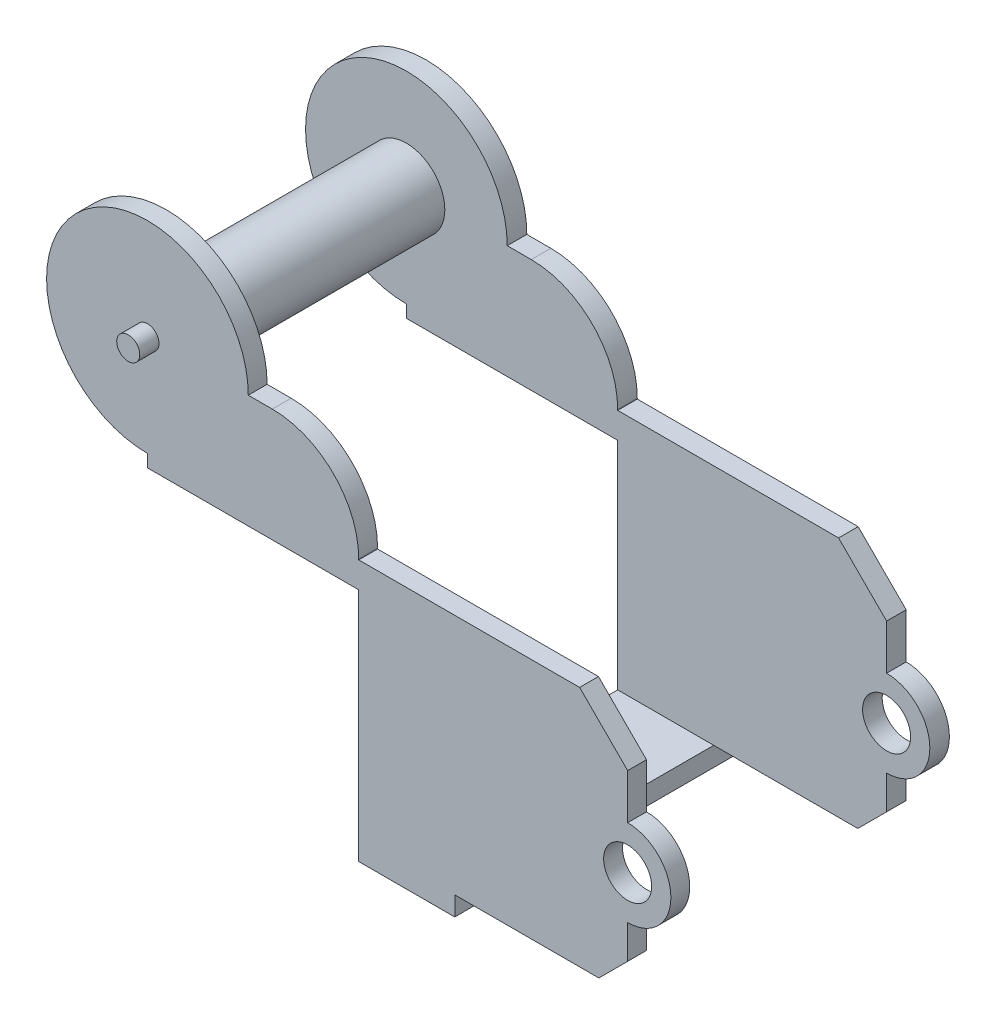
ISO-10303-21;
HEADER;
FILE_DESCRIPTION(('STEP AP214'),'2;1');
FILE_NAME('part.step','',(''),(''),'','','');
FILE_SCHEMA(('AUTOMOTIVE_DESIGN { 1 0 10303 214 1 1 1 1 }'));
ENDSEC;
DATA;
#1=APPLICATION_CONTEXT('core data for automotive mechanical design processes');
#2=APPLICATION_PROTOCOL_DEFINITION('international standard','automotive_design',2000,#1);
#3=PRODUCT_CONTEXT('',#1,'mechanical');
#4=PRODUCT('Part','Part','',(#3));
#5=PRODUCT_RELATED_PRODUCT_CATEGORY('part','',(#4));
#6=PRODUCT_DEFINITION_FORMATION('','',#4);
#7=PRODUCT_DEFINITION_CONTEXT('part definition',#1,'design');
#8=PRODUCT_DEFINITION('design','',#6,#7);
#9=PRODUCT_DEFINITION_SHAPE('','',#8);
#10=(LENGTH_UNIT() NAMED_UNIT(*) SI_UNIT(.MILLI.,.METRE.));
#11=(NAMED_UNIT(*) PLANE_ANGLE_UNIT() SI_UNIT($,.RADIAN.));
#12=(NAMED_UNIT(*) SI_UNIT($,.STERADIAN.) SOLID_ANGLE_UNIT());
#13=UNCERTAINTY_MEASURE_WITH_UNIT(LENGTH_MEASURE(1.E-05),#10,'distance_accuracy_value','');
#14=(GEOMETRIC_REPRESENTATION_CONTEXT(3) GLOBAL_UNCERTAINTY_ASSIGNED_CONTEXT((#13)) GLOBAL_UNIT_ASSIGNED_CONTEXT((#10,
#11,#12)) REPRESENTATION_CONTEXT('',''));
#15=CARTESIAN_POINT('',(0.,0.,0.));
#16=DIRECTION('',(0.,0.,1.));
#17=DIRECTION('',(1.,0.,0.));
#18=AXIS2_PLACEMENT_3D('',#15,#16,#17);
#19=CARTESIAN_POINT('',(-23.562506415874,1.656806257323E-12,29.));
#20=DIRECTION('',(-1.,0.,0.));
#21=DIRECTION('',(0.,-1.,0.));
#22=AXIS2_PLACEMENT_3D('',#19,#20,#21);
#23=PLANE('',#22);
#24=DIRECTION('',(0.,0.,-1.));
#25=VECTOR('',#24,1.);
#26=CARTESIAN_POINT('',(-23.562506415872,27.5988808660211,29.));
#27=LINE('',#26,#25);
#28=CARTESIAN_POINT('',(-23.562506415872,27.5988808660211,2.03798740926687));
#29=VERTEX_POINT('',#28);
#30=CARTESIAN_POINT('',(-23.562506415872,27.5988808660211,0.));
#31=VERTEX_POINT('',#30);
#32=EDGE_CURVE('E293',#29,#31,#27,.T.);
#33=ORIENTED_EDGE('',*,*,#32,.F.);
#34=DIRECTION('',(0.,-1.,0.));
#35=VECTOR('',#34,1.);
#36=CARTESIAN_POINT('',(-23.562506415874,1.656806257323E-12,2.03798740926687));
#37=LINE('',#36,#35);
#38=CARTESIAN_POINT('',(-23.5625064158721,27.5001983970195,2.03798740926687));
#39=VERTEX_POINT('',#38);
#40=EDGE_CURVE('E457',#29,#39,#37,.T.);
#41=ORIENTED_EDGE('',*,*,#40,.T.);
#42=DIRECTION('',(0.,0.,-1.));
#43=VECTOR('',#42,1.);
#44=CARTESIAN_POINT('',(-23.5625064158721,27.5001983970195,29.));
#45=LINE('',#44,#43);
#46=CARTESIAN_POINT('',(-23.5625064158721,27.5001983970195,0.));
#47=VERTEX_POINT('',#46);
#48=EDGE_CURVE('E117',#39,#47,#45,.T.);
#49=ORIENTED_EDGE('',*,*,#48,.T.);
#50=DIRECTION('',(0.,1.,0.));
#51=VECTOR('',#50,1.);
#52=CARTESIAN_POINT('',(-23.562506415874,1.656806257323E-12,0.));
#53=LINE('',#52,#51);
#54=EDGE_CURVE('E200',#47,#31,#53,.T.);
#55=ORIENTED_EDGE('',*,*,#54,.T.);
#56=EDGE_LOOP('',(#33,#41,#49,#55));
#57=FACE_BOUND('',#56,.T.);
#58=ADVANCED_FACE('F39',(#57),#23,.F.);
#59=CARTESIAN_POINT('',(-32.562506415872,27.5988808660211,29.));
#60=DIRECTION('',(0.,0.,-1.));
#61=DIRECTION('',(-1.,0.,0.));
#62=AXIS2_PLACEMENT_3D('',#59,#60,#61);
#63=CYLINDRICAL_SURFACE('',#62,9.);
#64=DIRECTION('',(0.,0.,-1.));
#65=VECTOR('',#64,1.);
#66=CARTESIAN_POINT('',(-32.5625064158721,36.5988808660211,29.));
#67=LINE('',#66,#65);
#68=CARTESIAN_POINT('',(-32.5625064158721,36.5988808660211,2.03798740926687));
#69=VERTEX_POINT('',#68);
#70=CARTESIAN_POINT('',(-32.5625064158721,36.5988808660211,0.));
#71=VERTEX_POINT('',#70);
#72=EDGE_CURVE('E289',#69,#71,#67,.T.);
#73=ORIENTED_EDGE('',*,*,#72,.F.);
#74=CARTESIAN_POINT('',(-32.562506415872,27.5988808660211,2.03798740926687));
#75=DIRECTION('',(0.,0.,-1.));
#76=DIRECTION('',(-1.,0.,0.));
#77=AXIS2_PLACEMENT_3D('',#74,#75,#76);
#78=CIRCLE('',#77,9.);
#79=EDGE_CURVE('E459',#69,#29,#78,.T.);
#80=ORIENTED_EDGE('',*,*,#79,.T.);
#81=ORIENTED_EDGE('',*,*,#32,.T.);
#82=CARTESIAN_POINT('',(-32.562506415872,27.5988808660211,0.));
#83=DIRECTION('',(0.,0.,1.));
#84=DIRECTION('',(1.,0.,0.));
#85=AXIS2_PLACEMENT_3D('',#82,#83,#84);
#86=CIRCLE('',#85,9.);
#87=EDGE_CURVE('E203',#31,#71,#86,.T.);
#88=ORIENTED_EDGE('',*,*,#87,.T.);
#89=EDGE_LOOP('',(#73,#80,#81,#88));
#90=FACE_BOUND('',#89,.T.);
#91=ADVANCED_FACE('F635',(#90),#63,.T.);
#92=CARTESIAN_POINT('',(0.,36.5988808660211,29.));
#93=DIRECTION('',(0.,-1.,0.));
#94=DIRECTION('',(0.,0.,-1.));
#95=AXIS2_PLACEMENT_3D('',#92,#93,#94);
#96=PLANE('',#95);
#97=DIRECTION('',(0.,0.,-1.));
#98=VECTOR('',#97,1.);
#99=CARTESIAN_POINT('',(-35.062506415872,36.5988808660211,29.));
#100=LINE('',#99,#98);
#101=CARTESIAN_POINT('',(-35.062506415872,36.5988808660211,2.03798740926687));
#102=VERTEX_POINT('',#101);
#103=CARTESIAN_POINT('',(-35.062506415872,36.5988808660211,0.));
#104=VERTEX_POINT('',#103);
#105=EDGE_CURVE('E285',#102,#104,#100,.T.);
#106=ORIENTED_EDGE('',*,*,#105,.F.);
#107=DIRECTION('',(1.,0.,0.));
#108=VECTOR('',#107,1.);
#109=CARTESIAN_POINT('',(0.,36.5988808660211,2.03798740926687));
#110=LINE('',#109,#108);
#111=EDGE_CURVE('E462',#102,#69,#110,.T.);
#112=ORIENTED_EDGE('',*,*,#111,.T.);
#113=ORIENTED_EDGE('',*,*,#72,.T.);
#114=DIRECTION('',(-1.,0.,0.));
#115=VECTOR('',#114,1.);
#116=CARTESIAN_POINT('',(0.,36.5988808660211,0.));
#117=LINE('',#116,#115);
#118=EDGE_CURVE('E206',#71,#104,#117,.T.);
#119=ORIENTED_EDGE('',*,*,#118,.T.);
#120=EDGE_LOOP('',(#106,#112,#113,#119));
#121=FACE_BOUND('',#120,.T.);
#122=ADVANCED_FACE('F639',(#121),#96,.F.);
#123=CARTESIAN_POINT('',(-45.562506415872,36.5988808660211,29.));
#124=DIRECTION('',(0.,0.,-1.));
#125=DIRECTION('',(-1.,0.,0.));
#126=AXIS2_PLACEMENT_3D('',#123,#124,#125);
#127=CYLINDRICAL_SURFACE('',#126,10.5);
#128=DIRECTION('',(0.,0.,-1.));
#129=VECTOR('',#128,1.);
#130=CARTESIAN_POINT('',(-45.562506415872,26.0988808660211,29.));
#131=LINE('',#130,#129);
#132=CARTESIAN_POINT('',(-45.562506415872,26.0988808660211,2.03798740926687));
#133=VERTEX_POINT('',#132);
#134=CARTESIAN_POINT('',(-45.562506415872,26.0988808660211,0.));
#135=VERTEX_POINT('',#134);
#136=EDGE_CURVE('E281',#133,#135,#131,.T.);
#137=ORIENTED_EDGE('',*,*,#136,.F.);
#138=CARTESIAN_POINT('',(-45.562506415872,36.5988808660211,2.03798740926687));
#139=DIRECTION('',(0.,0.,-1.));
#140=DIRECTION('',(-1.,0.,0.));
#141=AXIS2_PLACEMENT_3D('',#138,#139,#140);
#142=CIRCLE('',#141,10.5);
#143=EDGE_CURVE('E465',#133,#102,#142,.T.);
#144=ORIENTED_EDGE('',*,*,#143,.T.);
#145=ORIENTED_EDGE('',*,*,#105,.T.);
#146=CARTESIAN_POINT('',(-45.562506415872,36.5988808660211,0.));
#147=DIRECTION('',(0.,0.,1.));
#148=DIRECTION('',(1.,0.,0.));
#149=AXIS2_PLACEMENT_3D('',#146,#147,#148);
#150=CIRCLE('',#149,10.5);
#151=EDGE_CURVE('E209',#104,#135,#150,.T.);
#152=ORIENTED_EDGE('',*,*,#151,.T.);
#153=EDGE_LOOP('',(#137,#144,#145,#152));
#154=FACE_BOUND('',#153,.T.);
#155=ADVANCED_FACE('F654',(#154),#127,.T.);
#156=CARTESIAN_POINT('',(-45.562506415872,0.,29.));
#157=DIRECTION('',(-1.,0.,0.));
#158=DIRECTION('',(0.,0.,1.));
#159=AXIS2_PLACEMENT_3D('',#156,#157,#158);
#160=PLANE('',#159);
#161=DIRECTION('',(0.,-1.,0.));
#162=VECTOR('',#161,1.);
#163=CARTESIAN_POINT('',(-45.562506415872,0.,2.03798740926687));
#164=LINE('',#163,#162);
#165=CARTESIAN_POINT('',(-45.562506415872,24.7988808660211,2.03798740926687));
#166=VERTEX_POINT('',#165);
#167=EDGE_CURVE('E468',#133,#166,#164,.T.);
#168=ORIENTED_EDGE('',*,*,#167,.F.);
#169=ORIENTED_EDGE('',*,*,#136,.T.);
#170=DIRECTION('',(0.,1.,0.));
#171=VECTOR('',#170,1.);
#172=CARTESIAN_POINT('',(-45.562506415872,0.,0.));
#173=LINE('',#172,#171);
#174=CARTESIAN_POINT('',(-45.562506415872,24.7988808660211,0.));
#175=VERTEX_POINT('',#174);
#176=EDGE_CURVE('E212',#175,#135,#173,.T.);
#177=ORIENTED_EDGE('',*,*,#176,.F.);
#178=DIRECTION('',(0.,0.,-1.));
#179=VECTOR('',#178,1.);
#180=CARTESIAN_POINT('',(-45.562506415872,24.7988808660211,29.));
#181=LINE('',#180,#179);
#182=EDGE_CURVE('E277',#166,#175,#181,.T.);
#183=ORIENTED_EDGE('',*,*,#182,.F.);
#184=EDGE_LOOP('',(#168,#169,#177,#183));
#185=FACE_BOUND('',#184,.T.);
#186=ADVANCED_FACE('F657',(#185),#160,.T.);
#187=CARTESIAN_POINT('',(0.,24.7988808660211,29.));
#188=DIRECTION('',(0.,-1.,0.));
#189=DIRECTION('',(0.,0.,-1.));
#190=AXIS2_PLACEMENT_3D('',#187,#188,#189);
#191=PLANE('',#190);
#192=DIRECTION('',(1.,0.,0.));
#193=VECTOR('',#192,1.);
#194=CARTESIAN_POINT('',(0.,24.7988808660211,2.03798740926687));
#195=LINE('',#194,#193);
#196=CARTESIAN_POINT('',(-23.562506415872,24.7988808660211,2.03798740926687));
#197=VERTEX_POINT('',#196);
#198=EDGE_CURVE('E471',#166,#197,#195,.T.);
#199=ORIENTED_EDGE('',*,*,#198,.F.);
#200=ORIENTED_EDGE('',*,*,#182,.T.);
#201=DIRECTION('',(-1.,0.,0.));
#202=VECTOR('',#201,1.);
#203=CARTESIAN_POINT('',(0.,24.7988808660211,0.));
#204=LINE('',#203,#202);
#205=CARTESIAN_POINT('',(-23.562506415872,24.7988808660211,0.));
#206=VERTEX_POINT('',#205);
#207=EDGE_CURVE('E215',#206,#175,#204,.T.);
#208=ORIENTED_EDGE('',*,*,#207,.F.);
#209=DIRECTION('',(0.,0.,-1.));
#210=VECTOR('',#209,1.);
#211=CARTESIAN_POINT('',(-23.562506415872,24.7988808660211,29.));
#212=LINE('',#211,#210);
#213=EDGE_CURVE('E273',#197,#206,#212,.T.);
#214=ORIENTED_EDGE('',*,*,#213,.F.);
#215=EDGE_LOOP('',(#199,#200,#208,#214));
#216=FACE_BOUND('',#215,.T.);
#217=ADVANCED_FACE('F568',(#216),#191,.T.);
#218=CARTESIAN_POINT('',(0.,27.5001983970195,29.));
#219=DIRECTION('',(0.,-1.,0.));
#220=DIRECTION('',(1.,0.,0.));
#221=AXIS2_PLACEMENT_3D('',#218,#219,#220);
#222=PLANE('',#221);
#223=ORIENTED_EDGE('',*,*,#48,.F.);
#224=DIRECTION('',(1.,0.,0.));
#225=VECTOR('',#224,1.);
#226=CARTESIAN_POINT('',(0.,27.5001983970195,2.03798740926687));
#227=LINE('',#226,#225);
#228=CARTESIAN_POINT('',(-0.562506415872049,27.5001983970195,2.03798740926687));
#229=VERTEX_POINT('',#228);
#230=EDGE_CURVE('E11',#39,#229,#227,.T.);
#231=ORIENTED_EDGE('',*,*,#230,.T.);
#232=DIRECTION('',(0.,0.,-1.));
#233=VECTOR('',#232,1.);
#234=CARTESIAN_POINT('',(-0.562506415872049,27.5001983970195,29.));
#235=LINE('',#234,#233);
#236=CARTESIAN_POINT('',(-0.562506415872049,27.5001983970195,0.));
#237=VERTEX_POINT('',#236);
#238=EDGE_CURVE('E109',#229,#237,#235,.T.);
#239=ORIENTED_EDGE('',*,*,#238,.T.);
#240=DIRECTION('',(-1.,0.,0.));
#241=VECTOR('',#240,1.);
#242=CARTESIAN_POINT('',(0.,27.5001983970195,0.));
#243=LINE('',#242,#241);
#244=EDGE_CURVE('E242',#237,#47,#243,.T.);
#245=ORIENTED_EDGE('',*,*,#244,.T.);
#246=EDGE_LOOP('',(#223,#231,#239,#245));
#247=FACE_BOUND('',#246,.T.);
#248=ADVANCED_FACE('F533',(#247),#222,.F.);
#249=CARTESIAN_POINT('',(0.,2.29786024341674,29.));
#250=DIRECTION('',(0.,-1.,0.));
#251=DIRECTION('',(1.,0.,0.));
#252=AXIS2_PLACEMENT_3D('',#249,#250,#251);
#253=PLANE('',#252);
#254=DIRECTION('',(1.,0.,0.));
#255=VECTOR('',#254,1.);
#256=CARTESIAN_POINT('',(-13.562506415872,2.29786024341674,2.03798740926687));
#257=LINE('',#256,#255);
#258=CARTESIAN_POINT('',(-13.562506415872,2.29786024341674,2.03798740926687));
#259=VERTEX_POINT('',#258);
#260=CARTESIAN_POINT('',(1.43749358412795,2.29786024341674,2.03798740926687));
#261=VERTEX_POINT('',#260);
#262=EDGE_CURVE('E482',#259,#261,#257,.T.);
#263=ORIENTED_EDGE('',*,*,#262,.F.);
#264=DIRECTION('',(0.,0.,-1.));
#265=VECTOR('',#264,1.);
#266=CARTESIAN_POINT('',(-13.562506415872,2.29786024341674,29.));
#267=LINE('',#266,#265);
#268=CARTESIAN_POINT('',(-13.562506415872,2.29786024341674,0.));
#269=VERTEX_POINT('',#268);
#270=EDGE_CURVE('E263',#259,#269,#267,.T.);
#271=ORIENTED_EDGE('',*,*,#270,.T.);
#272=DIRECTION('',(-1.,0.,0.));
#273=VECTOR('',#272,1.);
#274=CARTESIAN_POINT('',(0.,2.29786024341674,0.));
#275=LINE('',#274,#273);
#276=CARTESIAN_POINT('',(1.43749358412795,2.29786024341674,0.));
#277=VERTEX_POINT('',#276);
#278=EDGE_CURVE('E225',#277,#269,#275,.T.);
#279=ORIENTED_EDGE('',*,*,#278,.F.);
#280=DIRECTION('',(0.,0.,-1.));
#281=VECTOR('',#280,1.);
#282=CARTESIAN_POINT('',(1.43749358412795,2.29786024341674,29.));
#283=LINE('',#282,#281);
#284=EDGE_CURVE('E259',#261,#277,#283,.T.);
#285=ORIENTED_EDGE('',*,*,#284,.F.);
#286=EDGE_LOOP('',(#263,#271,#279,#285));
#287=FACE_BOUND('',#286,.T.);
#288=ADVANCED_FACE('F625',(#287),#253,.T.);
#289=CARTESIAN_POINT('',(-0.430183329644394,0.430183329644394,29.));
#290=DIRECTION('',(0.707106781186548,-0.707106781186547,0.));
#291=DIRECTION('',(0.707106781186547,0.707106781186548,0.));
#292=AXIS2_PLACEMENT_3D('',#289,#290,#291);
#293=PLANE('',#292);
#294=DIRECTION('',(0.707106781186547,0.707106781186548,0.));
#295=VECTOR('',#294,1.);
#296=CARTESIAN_POINT('',(-0.430183329644394,0.430183329644394,2.03798740926687));
#297=LINE('',#296,#295);
#298=CARTESIAN_POINT('',(4.43749358412795,5.29786024341674,2.03798740926687));
#299=VERTEX_POINT('',#298);
#300=EDGE_CURVE('E391',#261,#299,#297,.T.);
#301=ORIENTED_EDGE('',*,*,#300,.F.);
#302=ORIENTED_EDGE('',*,*,#284,.T.);
#303=DIRECTION('',(-0.707106781186547,-0.707106781186548,0.));
#304=VECTOR('',#303,1.);
#305=CARTESIAN_POINT('',(-0.430183329644394,0.430183329644394,0.));
#306=LINE('',#305,#304);
#307=CARTESIAN_POINT('',(4.43749358412795,5.29786024341674,0.));
#308=VERTEX_POINT('',#307);
#309=EDGE_CURVE('E228',#308,#277,#306,.T.);
#310=ORIENTED_EDGE('',*,*,#309,.F.);
#311=DIRECTION('',(0.,0.,-1.));
#312=VECTOR('',#311,1.);
#313=CARTESIAN_POINT('',(4.43749358412795,5.29786024341674,29.));
#314=LINE('',#313,#312);
#315=EDGE_CURVE('E255',#299,#308,#314,.T.);
#316=ORIENTED_EDGE('',*,*,#315,.F.);
#317=EDGE_LOOP('',(#301,#302,#310,#316));
#318=FACE_BOUND('',#317,.T.);
#319=ADVANCED_FACE('F518',(#318),#293,.T.);
#320=CARTESIAN_POINT('',(4.43749358412795,0.,29.));
#321=DIRECTION('',(1.,0.,0.));
#322=DIRECTION('',(0.,0.,-1.));
#323=AXIS2_PLACEMENT_3D('',#320,#321,#322);
#324=PLANE('',#323);
#325=DIRECTION('',(0.,1.,0.));
#326=VECTOR('',#325,1.);
#327=CARTESIAN_POINT('',(4.43749358412795,0.,2.03798740926687));
#328=LINE('',#327,#326);
#329=CARTESIAN_POINT('',(4.43749358412795,8.79846408844878,2.03798740926687));
#330=VERTEX_POINT('',#329);
#331=EDGE_CURVE('E388',#299,#330,#328,.T.);
#332=ORIENTED_EDGE('',*,*,#331,.F.);
#333=ORIENTED_EDGE('',*,*,#315,.T.);
#334=DIRECTION('',(0.,-1.,0.));
#335=VECTOR('',#334,1.);
#336=CARTESIAN_POINT('',(4.43749358412795,0.,0.));
#337=LINE('',#336,#335);
#338=CARTESIAN_POINT('',(4.43749358412795,8.79846408844878,0.));
#339=VERTEX_POINT('',#338);
#340=EDGE_CURVE('E231',#339,#308,#337,.T.);
#341=ORIENTED_EDGE('',*,*,#340,.F.);
#342=DIRECTION('',(0.,0.,-1.));
#343=VECTOR('',#342,1.);
#344=CARTESIAN_POINT('',(4.43749358412795,8.79846408844878,29.));
#345=LINE('',#344,#343);
#346=EDGE_CURVE('E251',#330,#339,#345,.T.);
#347=ORIENTED_EDGE('',*,*,#346,.F.);
#348=EDGE_LOOP('',(#332,#333,#341,#347));
#349=FACE_BOUND('',#348,.T.);
#350=ADVANCED_FACE('F515',(#349),#324,.T.);
#351=CARTESIAN_POINT('',(4.43749358412795,13.2988808660211,29.));
#352=DIRECTION('',(0.,0.,-1.));
#353=DIRECTION('',(-1.,0.,0.));
#354=AXIS2_PLACEMENT_3D('',#351,#352,#353);
#355=CYLINDRICAL_SURFACE('',#354,4.50041677757234);
#356=DIRECTION('',(0.,0.,-1.));
#357=VECTOR('',#356,1.);
#358=CARTESIAN_POINT('',(4.43749358412795,17.7992976435935,29.));
#359=LINE('',#358,#357);
#360=CARTESIAN_POINT('',(4.43749358412795,17.7992976435935,2.03798740926687));
#361=VERTEX_POINT('',#360);
#362=CARTESIAN_POINT('',(4.43749358412795,17.7992976435935,0.));
#363=VERTEX_POINT('',#362);
#364=EDGE_CURVE('E187',#361,#363,#359,.T.);
#365=ORIENTED_EDGE('',*,*,#364,.F.);
#366=CARTESIAN_POINT('',(4.43749358412795,13.2988808660211,2.03798740926687));
#367=DIRECTION('',(0.,0.,-1.));
#368=DIRECTION('',(-1.,0.,0.));
#369=AXIS2_PLACEMENT_3D('',#366,#367,#368);
#370=CIRCLE('',#369,4.50041677757234);
#371=EDGE_CURVE('E385',#361,#330,#370,.T.);
#372=ORIENTED_EDGE('',*,*,#371,.T.);
#373=ORIENTED_EDGE('',*,*,#346,.T.);
#374=CARTESIAN_POINT('',(4.43749358412795,13.2988808660211,0.));
#375=DIRECTION('',(0.,0.,1.));
#376=DIRECTION('',(1.,0.,0.));
#377=AXIS2_PLACEMENT_3D('',#374,#375,#376);
#378=CIRCLE('',#377,4.50041677757234);
#379=EDGE_CURVE('E234',#339,#363,#378,.T.);
#380=ORIENTED_EDGE('',*,*,#379,.T.);
#381=EDGE_LOOP('',(#365,#372,#373,#380));
#382=FACE_BOUND('',#381,.T.);
#383=ADVANCED_FACE('F525',(#382),#355,.T.);
#384=CARTESIAN_POINT('',(4.43749358412796,0.,29.));
#385=DIRECTION('',(-1.,0.,0.));
#386=DIRECTION('',(0.,-1.,0.));
#387=AXIS2_PLACEMENT_3D('',#384,#385,#386);
#388=PLANE('',#387);
#389=DIRECTION('',(0.,0.,-1.));
#390=VECTOR('',#389,1.);
#391=CARTESIAN_POINT('',(4.43749358412795,22.5001983970195,29.));
#392=LINE('',#391,#390);
#393=CARTESIAN_POINT('',(4.43749358412795,22.5001983970195,2.03798740926687));
#394=VERTEX_POINT('',#393);
#395=CARTESIAN_POINT('',(4.43749358412795,22.5001983970195,0.));
#396=VERTEX_POINT('',#395);
#397=EDGE_CURVE('E188',#394,#396,#392,.T.);
#398=ORIENTED_EDGE('',*,*,#397,.F.);
#399=DIRECTION('',(0.,-1.,0.));
#400=VECTOR('',#399,1.);
#401=CARTESIAN_POINT('',(4.43749358412796,0.,2.03798740926687));
#402=LINE('',#401,#400);
#403=EDGE_CURVE('E382',#394,#361,#402,.T.);
#404=ORIENTED_EDGE('',*,*,#403,.T.);
#405=ORIENTED_EDGE('',*,*,#364,.T.);
#406=DIRECTION('',(0.,1.,0.));
#407=VECTOR('',#406,1.);
#408=CARTESIAN_POINT('',(4.43749358412796,0.,0.));
#409=LINE('',#408,#407);
#410=EDGE_CURVE('E237',#363,#396,#409,.T.);
#411=ORIENTED_EDGE('',*,*,#410,.T.);
#412=EDGE_LOOP('',(#398,#404,#405,#411));
#413=FACE_BOUND('',#412,.T.);
#414=ADVANCED_FACE('F528',(#413),#388,.F.);
#415=CARTESIAN_POINT('',(13.4688459905737,13.4688459905737,29.));
#416=DIRECTION('',(-0.707106781186548,-0.707106781186548,0.));
#417=DIRECTION('',(0.707106781186548,-0.707106781186548,0.));
#418=AXIS2_PLACEMENT_3D('',#415,#416,#417);
#419=PLANE('',#418);
#420=ORIENTED_EDGE('',*,*,#238,.F.);
#421=DIRECTION('',(0.707106781186548,-0.707106781186548,0.));
#422=VECTOR('',#421,1.);
#423=CARTESIAN_POINT('',(13.4688459905737,13.4688459905737,2.03798740926687));
#424=LINE('',#423,#422);
#425=EDGE_CURVE('E374',#229,#394,#424,.T.);
#426=ORIENTED_EDGE('',*,*,#425,.T.);
#427=ORIENTED_EDGE('',*,*,#397,.T.);
#428=DIRECTION('',(-0.707106781186548,0.707106781186548,0.));
#429=VECTOR('',#428,1.);
#430=CARTESIAN_POINT('',(13.4688459905737,13.4688459905737,0.));
#431=LINE('',#430,#429);
#432=EDGE_CURVE('E240',#396,#237,#431,.T.);
#433=ORIENTED_EDGE('',*,*,#432,.T.);
#434=EDGE_LOOP('',(#420,#426,#427,#433));
#435=FACE_BOUND('',#434,.T.);
#436=ADVANCED_FACE('F402',(#435),#419,.F.);
#437=CARTESIAN_POINT('',(4.43749358412795,13.2988808660211,29.));
#438=DIRECTION('',(0.,0.,-1.));
#439=DIRECTION('',(-1.,0.,0.));
#440=AXIS2_PLACEMENT_3D('',#437,#438,#439);
#441=CYLINDRICAL_SURFACE('',#440,2.50023195968281);
#442=CARTESIAN_POINT('',(4.43749358412795,13.2988808660211,2.03798740926687));
#443=DIRECTION('',(0.,0.,-1.));
#444=DIRECTION('',(-1.,0.,0.));
#445=AXIS2_PLACEMENT_3D('',#442,#443,#444);
#446=CIRCLE('',#445,2.50023195968281);
#447=CARTESIAN_POINT('',(1.93726162444514,13.2988808660211,2.03798740926687));
#448=VERTEX_POINT('',#447);
#449=EDGE_CURVE('E201',#448,#448,#446,.T.);
#450=ORIENTED_EDGE('',*,*,#449,.F.);
#451=EDGE_LOOP('',(#450));
#452=FACE_BOUND('',#451,.T.);
#453=CARTESIAN_POINT('',(4.43749358412795,13.2988808660211,0.));
#454=DIRECTION('',(0.,0.,1.));
#455=DIRECTION('',(1.,0.,0.));
#456=AXIS2_PLACEMENT_3D('',#453,#454,#455);
#457=CIRCLE('',#456,2.50023195968281);
#458=CARTESIAN_POINT('',(6.93772554381077,13.2988808660211,0.));
#459=VERTEX_POINT('',#458);
#460=EDGE_CURVE('E197',#459,#459,#457,.T.);
#461=ORIENTED_EDGE('',*,*,#460,.F.);
#462=EDGE_LOOP('',(#461));
#463=FACE_BOUND('',#462,.T.);
#464=ADVANCED_FACE('F399',(#452,#463),#441,.F.);
#465=CARTESIAN_POINT('',(-23.5625064158721,27.5001983970195,29.));
#466=VERTEX_POINT('',#465);
#467=CARTESIAN_POINT('',(-23.5625064158721,27.5001983970195,27.0379874092669));
#468=VERTEX_POINT('',#467);
#469=EDGE_CURVE('E245',#466,#468,#45,.T.);
#470=ORIENTED_EDGE('',*,*,#469,.T.);
#471=DIRECTION('',(0.,1.,0.));
#472=VECTOR('',#471,1.);
#473=CARTESIAN_POINT('',(-23.562506415874,1.656806257323E-12,27.0379874092669));
#474=LINE('',#473,#472);
#475=CARTESIAN_POINT('',(-23.562506415872,27.5988808660211,27.0379874092669));
#476=VERTEX_POINT('',#475);
#477=EDGE_CURVE('E310',#468,#476,#474,.T.);
#478=ORIENTED_EDGE('',*,*,#477,.T.);
#479=CARTESIAN_POINT('',(-23.562506415872,27.5988808660211,29.));
#480=VERTEX_POINT('',#479);
#481=EDGE_CURVE('E294',#480,#476,#27,.T.);
#482=ORIENTED_EDGE('',*,*,#481,.F.);
#483=DIRECTION('',(0.,1.,0.));
#484=VECTOR('',#483,1.);
#485=CARTESIAN_POINT('',(-23.562506415874,1.656806257323E-12,29.));
#486=LINE('',#485,#484);
#487=EDGE_CURVE('E322',#466,#480,#486,.T.);
#488=ORIENTED_EDGE('',*,*,#487,.F.);
#489=EDGE_LOOP('',(#470,#478,#482,#488));
#490=FACE_BOUND('',#489,.T.);
#491=ADVANCED_FACE('F321',(#490),#23,.F.);
#492=ORIENTED_EDGE('',*,*,#481,.T.);
#493=CARTESIAN_POINT('',(-32.562506415872,27.5988808660211,27.0379874092669));
#494=DIRECTION('',(0.,0.,1.));
#495=DIRECTION('',(1.,0.,0.));
#496=AXIS2_PLACEMENT_3D('',#493,#494,#495);
#497=CIRCLE('',#496,9.);
#498=CARTESIAN_POINT('',(-32.5625064158721,36.5988808660211,27.0379874092669));
#499=VERTEX_POINT('',#498);
#500=EDGE_CURVE('E316',#476,#499,#497,.T.);
#501=ORIENTED_EDGE('',*,*,#500,.T.);
#502=CARTESIAN_POINT('',(-32.5625064158721,36.5988808660211,29.));
#503=VERTEX_POINT('',#502);
#504=EDGE_CURVE('E290',#503,#499,#67,.T.);
#505=ORIENTED_EDGE('',*,*,#504,.F.);
#506=CARTESIAN_POINT('',(-32.562506415872,27.5988808660211,29.));
#507=DIRECTION('',(0.,0.,1.));
#508=DIRECTION('',(1.,0.,0.));
#509=AXIS2_PLACEMENT_3D('',#506,#507,#508);
#510=CIRCLE('',#509,9.);
#511=EDGE_CURVE('E125',#480,#503,#510,.T.);
#512=ORIENTED_EDGE('',*,*,#511,.F.);
#513=EDGE_LOOP('',(#492,#501,#505,#512));
#514=FACE_BOUND('',#513,.T.);
#515=ADVANCED_FACE('F608',(#514),#63,.T.);
#516=ORIENTED_EDGE('',*,*,#504,.T.);
#517=DIRECTION('',(-1.,0.,0.));
#518=VECTOR('',#517,1.);
#519=CARTESIAN_POINT('',(0.,36.5988808660211,27.0379874092669));
#520=LINE('',#519,#518);
#521=CARTESIAN_POINT('',(-35.062506415872,36.5988808660211,27.0379874092669));
#522=VERTEX_POINT('',#521);
#523=EDGE_CURVE('E442',#499,#522,#520,.T.);
#524=ORIENTED_EDGE('',*,*,#523,.T.);
#525=CARTESIAN_POINT('',(-35.062506415872,36.5988808660211,29.));
#526=VERTEX_POINT('',#525);
#527=EDGE_CURVE('E286',#526,#522,#100,.T.);
#528=ORIENTED_EDGE('',*,*,#527,.F.);
#529=DIRECTION('',(-1.,0.,0.));
#530=VECTOR('',#529,1.);
#531=CARTESIAN_POINT('',(0.,36.5988808660211,29.));
#532=LINE('',#531,#530);
#533=EDGE_CURVE('E324',#503,#526,#532,.T.);
#534=ORIENTED_EDGE('',*,*,#533,.F.);
#535=EDGE_LOOP('',(#516,#524,#528,#534));
#536=FACE_BOUND('',#535,.T.);
#537=ADVANCED_FACE('F605',(#536),#96,.F.);
#538=ORIENTED_EDGE('',*,*,#527,.T.);
#539=CARTESIAN_POINT('',(-45.562506415872,36.5988808660211,27.0379874092669));
#540=DIRECTION('',(0.,0.,1.));
#541=DIRECTION('',(1.,0.,0.));
#542=AXIS2_PLACEMENT_3D('',#539,#540,#541);
#543=CIRCLE('',#542,10.5);
#544=CARTESIAN_POINT('',(-45.562506415872,26.0988808660211,27.0379874092669));
#545=VERTEX_POINT('',#544);
#546=EDGE_CURVE('E445',#522,#545,#543,.T.);
#547=ORIENTED_EDGE('',*,*,#546,.T.);
#548=CARTESIAN_POINT('',(-45.562506415872,26.0988808660211,29.));
#549=VERTEX_POINT('',#548);
#550=EDGE_CURVE('E282',#549,#545,#131,.T.);
#551=ORIENTED_EDGE('',*,*,#550,.F.);
#552=CARTESIAN_POINT('',(-45.562506415872,36.5988808660211,29.));
#553=DIRECTION('',(0.,0.,1.));
#554=DIRECTION('',(1.,0.,0.));
#555=AXIS2_PLACEMENT_3D('',#552,#553,#554);
#556=CIRCLE('',#555,10.5);
#557=EDGE_CURVE('E331',#526,#549,#556,.T.);
#558=ORIENTED_EDGE('',*,*,#557,.F.);
#559=EDGE_LOOP('',(#538,#547,#551,#558));
#560=FACE_BOUND('',#559,.T.);
#561=ADVANCED_FACE('F600',(#560),#127,.T.);
#562=DIRECTION('',(0.,1.,0.));
#563=VECTOR('',#562,1.);
#564=CARTESIAN_POINT('',(-45.562506415872,0.,27.0379874092669));
#565=LINE('',#564,#563);
#566=CARTESIAN_POINT('',(-45.562506415872,24.7988808660211,27.0379874092669));
#567=VERTEX_POINT('',#566);
#568=EDGE_CURVE('E448',#567,#545,#565,.T.);
#569=ORIENTED_EDGE('',*,*,#568,.F.);
#570=CARTESIAN_POINT('',(-45.562506415872,24.7988808660211,29.));
#571=VERTEX_POINT('',#570);
#572=EDGE_CURVE('E278',#571,#567,#181,.T.);
#573=ORIENTED_EDGE('',*,*,#572,.F.);
#574=DIRECTION('',(0.,1.,0.));
#575=VECTOR('',#574,1.);
#576=CARTESIAN_POINT('',(-45.562506415872,0.,29.));
#577=LINE('',#576,#575);
#578=EDGE_CURVE('E333',#571,#549,#577,.T.);
#579=ORIENTED_EDGE('',*,*,#578,.T.);
#580=ORIENTED_EDGE('',*,*,#550,.T.);
#581=EDGE_LOOP('',(#569,#573,#579,#580));
#582=FACE_BOUND('',#581,.T.);
#583=ADVANCED_FACE('F594',(#582),#160,.T.);
#584=DIRECTION('',(-1.,0.,0.));
#585=VECTOR('',#584,1.);
#586=CARTESIAN_POINT('',(0.,24.7988808660211,27.0379874092669));
#587=LINE('',#586,#585);
#588=CARTESIAN_POINT('',(-23.562506415872,24.7988808660211,27.0379874092669));
#589=VERTEX_POINT('',#588);
#590=EDGE_CURVE('E451',#589,#567,#587,.T.);
#591=ORIENTED_EDGE('',*,*,#590,.F.);
#592=CARTESIAN_POINT('',(-23.562506415872,24.7988808660211,29.));
#593=VERTEX_POINT('',#592);
#594=EDGE_CURVE('E274',#593,#589,#212,.T.);
#595=ORIENTED_EDGE('',*,*,#594,.F.);
#596=DIRECTION('',(-1.,0.,0.));
#597=VECTOR('',#596,1.);
#598=CARTESIAN_POINT('',(0.,24.7988808660211,29.));
#599=LINE('',#598,#597);
#600=EDGE_CURVE('E336',#593,#571,#599,.T.);
#601=ORIENTED_EDGE('',*,*,#600,.T.);
#602=ORIENTED_EDGE('',*,*,#572,.T.);
#603=EDGE_LOOP('',(#591,#595,#601,#602));
#604=FACE_BOUND('',#603,.T.);
#605=ADVANCED_FACE('F587',(#604),#191,.T.);
#606=CARTESIAN_POINT('',(-23.562506415872,0.,29.));
#607=DIRECTION('',(1.,0.,0.));
#608=DIRECTION('',(0.,1.,0.));
#609=AXIS2_PLACEMENT_3D('',#606,#607,#608);
#610=PLANE('',#609);
#611=DIRECTION('',(0.,0.,-1.));
#612=VECTOR('',#611,1.);
#613=CARTESIAN_POINT('',(-23.562506415872,2.29786024341677,29.));
#614=LINE('',#613,#612);
#615=CARTESIAN_POINT('',(-23.562506415872,2.29786024341677,27.0379874092669));
#616=VERTEX_POINT('',#615);
#617=CARTESIAN_POINT('',(-23.562506415872,2.29786024341677,2.03798740926687));
#618=VERTEX_POINT('',#617);
#619=EDGE_CURVE('E477',#616,#618,#614,.T.);
#620=ORIENTED_EDGE('',*,*,#619,.T.);
#621=DIRECTION('',(0.,1.,0.));
#622=VECTOR('',#621,1.);
#623=CARTESIAN_POINT('',(-23.562506415872,0.,2.03798740926687));
#624=LINE('',#623,#622);
#625=EDGE_CURVE('E474',#618,#197,#624,.T.);
#626=ORIENTED_EDGE('',*,*,#625,.T.);
#627=ORIENTED_EDGE('',*,*,#213,.T.);
#628=DIRECTION('',(0.,-1.,0.));
#629=VECTOR('',#628,1.);
#630=CARTESIAN_POINT('',(-23.562506415872,0.,0.));
#631=LINE('',#630,#629);
#632=CARTESIAN_POINT('',(-23.562506415872,0.297860243416739,0.));
#633=VERTEX_POINT('',#632);
#634=EDGE_CURVE('E218',#206,#633,#631,.T.);
#635=ORIENTED_EDGE('',*,*,#634,.T.);
#636=DIRECTION('',(0.,0.,-1.));
#637=VECTOR('',#636,1.);
#638=CARTESIAN_POINT('',(-23.562506415872,0.297860243416739,29.));
#639=LINE('',#638,#637);
#640=CARTESIAN_POINT('',(-23.562506415872,0.297860243416739,29.));
#641=VERTEX_POINT('',#640);
#642=EDGE_CURVE('E270',#641,#633,#639,.T.);
#643=ORIENTED_EDGE('',*,*,#642,.F.);
#644=DIRECTION('',(0.,-1.,0.));
#645=VECTOR('',#644,1.);
#646=CARTESIAN_POINT('',(-23.562506415872,0.,29.));
#647=LINE('',#646,#645);
#648=EDGE_CURVE('E339',#593,#641,#647,.T.);
#649=ORIENTED_EDGE('',*,*,#648,.F.);
#650=ORIENTED_EDGE('',*,*,#594,.T.);
#651=DIRECTION('',(0.,-1.,0.));
#652=VECTOR('',#651,1.);
#653=CARTESIAN_POINT('',(-23.562506415872,0.,27.0379874092669));
#654=LINE('',#653,#652);
#655=EDGE_CURVE('E454',#589,#616,#654,.T.);
#656=ORIENTED_EDGE('',*,*,#655,.T.);
#657=EDGE_LOOP('',(#620,#626,#627,#635,#643,#649,#650,#656));
#658=FACE_BOUND('',#657,.T.);
#659=ADVANCED_FACE('F564',(#658),#610,.F.);
#660=CARTESIAN_POINT('',(0.,0.297860243416739,29.));
#661=DIRECTION('',(0.,1.,0.));
#662=DIRECTION('',(0.,0.,1.));
#663=AXIS2_PLACEMENT_3D('',#660,#661,#662);
#664=PLANE('',#663);
#665=DIRECTION('',(1.,0.,0.));
#666=VECTOR('',#665,1.);
#667=CARTESIAN_POINT('',(0.,0.297860243416739,0.));
#668=LINE('',#667,#666);
#669=CARTESIAN_POINT('',(-13.562506415872,0.297860243416739,0.));
#670=VERTEX_POINT('',#669);
#671=EDGE_CURVE('E220',#633,#670,#668,.T.);
#672=ORIENTED_EDGE('',*,*,#671,.T.);
#673=DIRECTION('',(0.,0.,-1.));
#674=VECTOR('',#673,1.);
#675=CARTESIAN_POINT('',(-13.562506415872,0.297860243416739,29.));
#676=LINE('',#675,#674);
#677=CARTESIAN_POINT('',(-13.562506415872,0.297860243416739,29.));
#678=VERTEX_POINT('',#677);
#679=EDGE_CURVE('E267',#678,#670,#676,.T.);
#680=ORIENTED_EDGE('',*,*,#679,.F.);
#681=DIRECTION('',(1.,0.,0.));
#682=VECTOR('',#681,1.);
#683=CARTESIAN_POINT('',(0.,0.297860243416739,29.));
#684=LINE('',#683,#682);
#685=EDGE_CURVE('E341',#641,#678,#684,.T.);
#686=ORIENTED_EDGE('',*,*,#685,.F.);
#687=ORIENTED_EDGE('',*,*,#642,.T.);
#688=EDGE_LOOP('',(#672,#680,#686,#687));
#689=FACE_BOUND('',#688,.T.);
#690=ADVANCED_FACE('F577',(#689),#664,.F.);
#691=CARTESIAN_POINT('',(-13.562506415872,0.,29.));
#692=DIRECTION('',(-1.,0.,0.));
#693=DIRECTION('',(0.,-1.,0.));
#694=AXIS2_PLACEMENT_3D('',#691,#692,#693);
#695=PLANE('',#694);
#696=ORIENTED_EDGE('',*,*,#270,.F.);
#697=DIRECTION('',(0.,0.,-1.));
#698=VECTOR('',#697,1.);
#699=CARTESIAN_POINT('',(-13.562506415872,2.29786024341674,2.03798740926687));
#700=LINE('',#699,#698);
#701=CARTESIAN_POINT('',(-13.562506415872,2.29786024341674,27.0379874092669));
#702=VERTEX_POINT('',#701);
#703=EDGE_CURVE('E433',#702,#259,#700,.T.);
#704=ORIENTED_EDGE('',*,*,#703,.F.);
#705=CARTESIAN_POINT('',(-13.562506415872,2.29786024341674,29.));
#706=VERTEX_POINT('',#705);
#707=EDGE_CURVE('E264',#706,#702,#267,.T.);
#708=ORIENTED_EDGE('',*,*,#707,.F.);
#709=DIRECTION('',(0.,1.,0.));
#710=VECTOR('',#709,1.);
#711=CARTESIAN_POINT('',(-13.562506415872,0.,29.));
#712=LINE('',#711,#710);
#713=EDGE_CURVE('E343',#678,#706,#712,.T.);
#714=ORIENTED_EDGE('',*,*,#713,.F.);
#715=ORIENTED_EDGE('',*,*,#679,.T.);
#716=DIRECTION('',(0.,1.,0.));
#717=VECTOR('',#716,1.);
#718=CARTESIAN_POINT('',(-13.562506415872,0.,0.));
#719=LINE('',#718,#717);
#720=EDGE_CURVE('E222',#670,#269,#719,.T.);
#721=ORIENTED_EDGE('',*,*,#720,.T.);
#722=EDGE_LOOP('',(#696,#704,#708,#714,#715,#721));
#723=FACE_BOUND('',#722,.T.);
#724=ADVANCED_FACE('F620',(#723),#695,.F.);
#725=DIRECTION('',(-1.,0.,0.));
#726=VECTOR('',#725,1.);
#727=CARTESIAN_POINT('',(-13.562506415872,2.29786024341674,27.0379874092669));
#728=LINE('',#727,#726);
#729=CARTESIAN_POINT('',(1.43749358412795,2.29786024341674,27.0379874092669));
#730=VERTEX_POINT('',#729);
#731=EDGE_CURVE('E480',#730,#702,#728,.T.);
#732=ORIENTED_EDGE('',*,*,#731,.F.);
#733=CARTESIAN_POINT('',(1.43749358412795,2.29786024341674,29.));
#734=VERTEX_POINT('',#733);
#735=EDGE_CURVE('E260',#734,#730,#283,.T.);
#736=ORIENTED_EDGE('',*,*,#735,.F.);
#737=DIRECTION('',(-1.,0.,0.));
#738=VECTOR('',#737,1.);
#739=CARTESIAN_POINT('',(0.,2.29786024341674,29.));
#740=LINE('',#739,#738);
#741=EDGE_CURVE('E345',#734,#706,#740,.T.);
#742=ORIENTED_EDGE('',*,*,#741,.T.);
#743=ORIENTED_EDGE('',*,*,#707,.T.);
#744=EDGE_LOOP('',(#732,#736,#742,#743));
#745=FACE_BOUND('',#744,.T.);
#746=ADVANCED_FACE('F622',(#745),#253,.T.);
#747=DIRECTION('',(-0.707106781186547,-0.707106781186548,0.));
#748=VECTOR('',#747,1.);
#749=CARTESIAN_POINT('',(-0.430183329644394,0.430183329644394,27.0379874092669));
#750=LINE('',#749,#748);
#751=CARTESIAN_POINT('',(4.43749358412795,5.29786024341674,27.0379874092669));
#752=VERTEX_POINT('',#751);
#753=EDGE_CURVE('E363',#752,#730,#750,.T.);
#754=ORIENTED_EDGE('',*,*,#753,.F.);
#755=CARTESIAN_POINT('',(4.43749358412795,5.29786024341674,29.));
#756=VERTEX_POINT('',#755);
#757=EDGE_CURVE('E256',#756,#752,#314,.T.);
#758=ORIENTED_EDGE('',*,*,#757,.F.);
#759=DIRECTION('',(-0.707106781186547,-0.707106781186548,0.));
#760=VECTOR('',#759,1.);
#761=CARTESIAN_POINT('',(-0.430183329644394,0.430183329644394,29.));
#762=LINE('',#761,#760);
#763=EDGE_CURVE('E348',#756,#734,#762,.T.);
#764=ORIENTED_EDGE('',*,*,#763,.T.);
#765=ORIENTED_EDGE('',*,*,#735,.T.);
#766=EDGE_LOOP('',(#754,#758,#764,#765));
#767=FACE_BOUND('',#766,.T.);
#768=ADVANCED_FACE('F361',(#767),#293,.T.);
#769=DIRECTION('',(0.,-1.,0.));
#770=VECTOR('',#769,1.);
#771=CARTESIAN_POINT('',(4.43749358412795,0.,27.0379874092669));
#772=LINE('',#771,#770);
#773=CARTESIAN_POINT('',(4.43749358412795,8.79846408844878,27.0379874092669));
#774=VERTEX_POINT('',#773);
#775=EDGE_CURVE('E371',#774,#752,#772,.T.);
#776=ORIENTED_EDGE('',*,*,#775,.F.);
#777=CARTESIAN_POINT('',(4.43749358412795,8.79846408844878,29.));
#778=VERTEX_POINT('',#777);
#779=EDGE_CURVE('E252',#778,#774,#345,.T.);
#780=ORIENTED_EDGE('',*,*,#779,.F.);
#781=DIRECTION('',(0.,-1.,0.));
#782=VECTOR('',#781,1.);
#783=CARTESIAN_POINT('',(4.43749358412795,0.,29.));
#784=LINE('',#783,#782);
#785=EDGE_CURVE('E351',#778,#756,#784,.T.);
#786=ORIENTED_EDGE('',*,*,#785,.T.);
#787=ORIENTED_EDGE('',*,*,#757,.T.);
#788=EDGE_LOOP('',(#776,#780,#786,#787));
#789=FACE_BOUND('',#788,.T.);
#790=ADVANCED_FACE('F355',(#789),#324,.T.);
#791=ORIENTED_EDGE('',*,*,#779,.T.);
#792=CARTESIAN_POINT('',(4.43749358412795,13.2988808660211,27.0379874092669));
#793=DIRECTION('',(0.,0.,1.));
#794=DIRECTION('',(1.,0.,0.));
#795=AXIS2_PLACEMENT_3D('',#792,#793,#794);
#796=CIRCLE('',#795,4.50041677757234);
#797=CARTESIAN_POINT('',(4.43749358412795,17.7992976435935,27.0379874092669));
#798=VERTEX_POINT('',#797);
#799=EDGE_CURVE('E376',#774,#798,#796,.T.);
#800=ORIENTED_EDGE('',*,*,#799,.T.);
#801=CARTESIAN_POINT('',(4.43749358412795,17.7992976435935,29.));
#802=VERTEX_POINT('',#801);
#803=EDGE_CURVE('E249',#802,#798,#359,.T.);
#804=ORIENTED_EDGE('',*,*,#803,.F.);
#805=CARTESIAN_POINT('',(4.43749358412795,13.2988808660211,29.));
#806=DIRECTION('',(0.,0.,1.));
#807=DIRECTION('',(1.,0.,0.));
#808=AXIS2_PLACEMENT_3D('',#805,#806,#807);
#809=CIRCLE('',#808,4.50041677757234);
#810=EDGE_CURVE('E173',#778,#802,#809,.T.);
#811=ORIENTED_EDGE('',*,*,#810,.F.);
#812=EDGE_LOOP('',(#791,#800,#804,#811));
#813=FACE_BOUND('',#812,.T.);
#814=ADVANCED_FACE('F491',(#813),#355,.T.);
#815=ORIENTED_EDGE('',*,*,#803,.T.);
#816=DIRECTION('',(0.,1.,0.));
#817=VECTOR('',#816,1.);
#818=CARTESIAN_POINT('',(4.43749358412796,0.,27.0379874092669));
#819=LINE('',#818,#817);
#820=CARTESIAN_POINT('',(4.43749358412795,22.5001983970195,27.0379874092669));
#821=VERTEX_POINT('',#820);
#822=EDGE_CURVE('E184',#798,#821,#819,.T.);
#823=ORIENTED_EDGE('',*,*,#822,.T.);
#824=CARTESIAN_POINT('',(4.43749358412795,22.5001983970195,29.));
#825=VERTEX_POINT('',#824);
#826=EDGE_CURVE('E180',#825,#821,#392,.T.);
#827=ORIENTED_EDGE('',*,*,#826,.F.);
#828=DIRECTION('',(0.,1.,0.));
#829=VECTOR('',#828,1.);
#830=CARTESIAN_POINT('',(4.43749358412796,0.,29.));
#831=LINE('',#830,#829);
#832=EDGE_CURVE('E164',#802,#825,#831,.T.);
#833=ORIENTED_EDGE('',*,*,#832,.F.);
#834=EDGE_LOOP('',(#815,#823,#827,#833));
#835=FACE_BOUND('',#834,.T.);
#836=ADVANCED_FACE('F181',(#835),#388,.F.);
#837=ORIENTED_EDGE('',*,*,#826,.T.);
#838=DIRECTION('',(-0.707106781186548,0.707106781186548,0.));
#839=VECTOR('',#838,1.);
#840=CARTESIAN_POINT('',(13.4688459905737,13.4688459905737,27.0379874092669));
#841=LINE('',#840,#839);
#842=CARTESIAN_POINT('',(-0.562506415872049,27.5001983970195,27.0379874092669));
#843=VERTEX_POINT('',#842);
#844=EDGE_CURVE('E485',#821,#843,#841,.T.);
#845=ORIENTED_EDGE('',*,*,#844,.T.);
#846=CARTESIAN_POINT('',(-0.562506415872049,27.5001983970195,29.));
#847=VERTEX_POINT('',#846);
#848=EDGE_CURVE('E192',#847,#843,#235,.T.);
#849=ORIENTED_EDGE('',*,*,#848,.F.);
#850=DIRECTION('',(-0.707106781186548,0.707106781186548,0.));
#851=VECTOR('',#850,1.);
#852=CARTESIAN_POINT('',(13.4688459905737,13.4688459905737,29.));
#853=LINE('',#852,#851);
#854=EDGE_CURVE('E169',#825,#847,#853,.T.);
#855=ORIENTED_EDGE('',*,*,#854,.F.);
#856=EDGE_LOOP('',(#837,#845,#849,#855));
#857=FACE_BOUND('',#856,.T.);
#858=ADVANCED_FACE('F190',(#857),#419,.F.);
#859=CARTESIAN_POINT('',(4.43749358412795,13.2988808660211,27.0379874092669));
#860=DIRECTION('',(0.,0.,1.));
#861=DIRECTION('',(1.,0.,0.));
#862=AXIS2_PLACEMENT_3D('',#859,#860,#861);
#863=CIRCLE('',#862,2.50023195968281);
#864=CARTESIAN_POINT('',(6.93772554381077,13.2988808660211,27.0379874092669));
#865=VERTEX_POINT('',#864);
#866=EDGE_CURVE('E370',#865,#865,#863,.T.);
#867=ORIENTED_EDGE('',*,*,#866,.F.);
#868=EDGE_LOOP('',(#867));
#869=FACE_BOUND('',#868,.T.);
#870=CARTESIAN_POINT('',(4.43749358412795,13.2988808660211,29.));
#871=DIRECTION('',(0.,0.,1.));
#872=DIRECTION('',(1.,0.,0.));
#873=AXIS2_PLACEMENT_3D('',#870,#871,#872);
#874=CIRCLE('',#873,2.50023195968281);
#875=CARTESIAN_POINT('',(6.93772554381077,13.2988808660211,29.));
#876=VERTEX_POINT('',#875);
#877=EDGE_CURVE('E244',#876,#876,#874,.T.);
#878=ORIENTED_EDGE('',*,*,#877,.T.);
#879=EDGE_LOOP('',(#878));
#880=FACE_BOUND('',#879,.T.);
#881=ADVANCED_FACE('F41',(#869,#880),#441,.F.);
#882=DIRECTION('',(-1.,0.,0.));
#883=VECTOR('',#882,1.);
#884=CARTESIAN_POINT('',(0.,27.5001983970195,27.0379874092669));
#885=LINE('',#884,#883);
#886=EDGE_CURVE('E48',#843,#468,#885,.T.);
#887=ORIENTED_EDGE('',*,*,#886,.T.);
#888=ORIENTED_EDGE('',*,*,#469,.F.);
#889=DIRECTION('',(-1.,0.,0.));
#890=VECTOR('',#889,1.);
#891=CARTESIAN_POINT('',(0.,27.5001983970195,29.));
#892=LINE('',#891,#890);
#893=EDGE_CURVE('E56',#847,#466,#892,.T.);
#894=ORIENTED_EDGE('',*,*,#893,.F.);
#895=ORIENTED_EDGE('',*,*,#848,.T.);
#896=EDGE_LOOP('',(#887,#888,#894,#895));
#897=FACE_BOUND('',#896,.T.);
#898=ADVANCED_FACE('F300',(#897),#222,.F.);
#899=CARTESIAN_POINT('',(0.,0.,29.));
#900=DIRECTION('',(0.,0.,1.));
#901=DIRECTION('',(1.,0.,0.));
#902=AXIS2_PLACEMENT_3D('',#899,#900,#901);
#903=PLANE('',#902);
#904=ORIENTED_EDGE('',*,*,#877,.F.);
#905=EDGE_LOOP('',(#904));
#906=FACE_BOUND('',#905,.T.);
#907=ORIENTED_EDGE('',*,*,#487,.T.);
#908=ORIENTED_EDGE('',*,*,#511,.T.);
#909=ORIENTED_EDGE('',*,*,#533,.T.);
#910=ORIENTED_EDGE('',*,*,#557,.T.);
#911=ORIENTED_EDGE('',*,*,#578,.F.);
#912=ORIENTED_EDGE('',*,*,#600,.F.);
#913=ORIENTED_EDGE('',*,*,#648,.T.);
#914=ORIENTED_EDGE('',*,*,#685,.T.);
#915=ORIENTED_EDGE('',*,*,#713,.T.);
#916=ORIENTED_EDGE('',*,*,#741,.F.);
#917=ORIENTED_EDGE('',*,*,#763,.F.);
#918=ORIENTED_EDGE('',*,*,#785,.F.);
#919=ORIENTED_EDGE('',*,*,#810,.T.);
#920=ORIENTED_EDGE('',*,*,#832,.T.);
#921=ORIENTED_EDGE('',*,*,#854,.T.);
#922=ORIENTED_EDGE('',*,*,#893,.T.);
#923=EDGE_LOOP('',(#907,#908,#909,#910,#911,#912,#913,#914,#915,#916,#917,#918,#919,#920,#921,#922));
#924=FACE_BOUND('',#923,.T.);
#925=CARTESIAN_POINT('',(-45.562506415872,36.5988808660211,29.));
#926=DIRECTION('',(0.,0.,1.));
#927=DIRECTION('',(1.,0.,0.));
#928=AXIS2_PLACEMENT_3D('',#925,#926,#927);
#929=CIRCLE('',#928,1.2);
#930=CARTESIAN_POINT('',(-44.362506415872,36.5988808660211,29.));
#931=VERTEX_POINT('',#930);
#932=EDGE_CURVE('E417',#931,#931,#929,.T.);
#933=ORIENTED_EDGE('',*,*,#932,.F.);
#934=EDGE_LOOP('',(#933));
#935=FACE_BOUND('',#934,.T.);
#936=ADVANCED_FACE('F166',(#906,#924,#935),#903,.T.);
#937=CARTESIAN_POINT('',(0.,0.,0.));
#938=DIRECTION('',(0.,0.,1.));
#939=DIRECTION('',(1.,0.,0.));
#940=AXIS2_PLACEMENT_3D('',#937,#938,#939);
#941=PLANE('',#940);
#942=ORIENTED_EDGE('',*,*,#460,.T.);
#943=EDGE_LOOP('',(#942));
#944=FACE_BOUND('',#943,.T.);
#945=ORIENTED_EDGE('',*,*,#54,.F.);
#946=ORIENTED_EDGE('',*,*,#244,.F.);
#947=ORIENTED_EDGE('',*,*,#432,.F.);
#948=ORIENTED_EDGE('',*,*,#410,.F.);
#949=ORIENTED_EDGE('',*,*,#379,.F.);
#950=ORIENTED_EDGE('',*,*,#340,.T.);
#951=ORIENTED_EDGE('',*,*,#309,.T.);
#952=ORIENTED_EDGE('',*,*,#278,.T.);
#953=ORIENTED_EDGE('',*,*,#720,.F.);
#954=ORIENTED_EDGE('',*,*,#671,.F.);
#955=ORIENTED_EDGE('',*,*,#634,.F.);
#956=ORIENTED_EDGE('',*,*,#207,.T.);
#957=ORIENTED_EDGE('',*,*,#176,.T.);
#958=ORIENTED_EDGE('',*,*,#151,.F.);
#959=ORIENTED_EDGE('',*,*,#118,.F.);
#960=ORIENTED_EDGE('',*,*,#87,.F.);
#961=EDGE_LOOP('',(#945,#946,#947,#948,#949,#950,#951,#952,#953,#954,#955,#956,#957,#958,#959,#960));
#962=FACE_BOUND('',#961,.T.);
#963=CARTESIAN_POINT('',(-45.562506415872,36.5988808660211,0.));
#964=DIRECTION('',(0.,0.,1.));
#965=DIRECTION('',(1.,0.,0.));
#966=AXIS2_PLACEMENT_3D('',#963,#964,#965);
#967=CIRCLE('',#966,1.19999999999999);
#968=CARTESIAN_POINT('',(-44.362506415872,36.5988808660211,0.));
#969=VERTEX_POINT('',#968);
#970=EDGE_CURVE('E415',#969,#969,#967,.T.);
#971=ORIENTED_EDGE('',*,*,#970,.T.);
#972=EDGE_LOOP('',(#971));
#973=FACE_BOUND('',#972,.T.);
#974=ADVANCED_FACE('F405',(#944,#962,#973),#941,.F.);
#975=CARTESIAN_POINT('',(-13.562506415872,52.2978602434167,2.03798740926687));
#976=DIRECTION('',(0.,0.,-1.));
#977=DIRECTION('',(-1.,0.,0.));
#978=AXIS2_PLACEMENT_3D('',#975,#976,#977);
#979=PLANE('',#978);
#980=ORIENTED_EDGE('',*,*,#449,.T.);
#981=EDGE_LOOP('',(#980));
#982=FACE_BOUND('',#981,.T.);
#983=ORIENTED_EDGE('',*,*,#300,.T.);
#984=ORIENTED_EDGE('',*,*,#331,.T.);
#985=ORIENTED_EDGE('',*,*,#371,.F.);
#986=ORIENTED_EDGE('',*,*,#403,.F.);
#987=ORIENTED_EDGE('',*,*,#425,.F.);
#988=ORIENTED_EDGE('',*,*,#230,.F.);
#989=ORIENTED_EDGE('',*,*,#40,.F.);
#990=ORIENTED_EDGE('',*,*,#79,.F.);
#991=ORIENTED_EDGE('',*,*,#111,.F.);
#992=ORIENTED_EDGE('',*,*,#143,.F.);
#993=ORIENTED_EDGE('',*,*,#167,.T.);
#994=ORIENTED_EDGE('',*,*,#198,.T.);
#995=ORIENTED_EDGE('',*,*,#625,.F.);
#996=DIRECTION('',(1.,0.,0.));
#997=VECTOR('',#996,1.);
#998=CARTESIAN_POINT('',(-63.5625064158721,2.29786024341687,2.03798740926687));
#999=LINE('',#998,#997);
#1000=EDGE_CURVE('E319',#618,#259,#999,.T.);
#1001=ORIENTED_EDGE('',*,*,#1000,.T.);
#1002=ORIENTED_EDGE('',*,*,#262,.T.);
#1003=EDGE_LOOP('',(#983,#984,#985,#986,#987,#988,#989,#990,#991,#992,#993,#994,#995,#1001,#1002));
#1004=FACE_BOUND('',#1003,.T.);
#1005=CARTESIAN_POINT('',(-45.562506415872,36.5988808660211,2.03798740926687));
#1006=DIRECTION('',(0.,0.,-1.));
#1007=DIRECTION('',(-1.,0.,0.));
#1008=AXIS2_PLACEMENT_3D('',#1005,#1006,#1007);
#1009=CIRCLE('',#1008,4.);
#1010=CARTESIAN_POINT('',(-49.562506415872,36.5988808660211,2.03798740926687));
#1011=VERTEX_POINT('',#1010);
#1012=EDGE_CURVE('E430',#1011,#1011,#1009,.T.);
#1013=ORIENTED_EDGE('',*,*,#1012,.T.);
#1014=EDGE_LOOP('',(#1013));
#1015=FACE_BOUND('',#1014,.T.);
#1016=ADVANCED_FACE('F396',(#982,#1004,#1015),#979,.F.);
#1017=CARTESIAN_POINT('',(-13.562506415872,52.2978602434167,27.0379874092669));
#1018=DIRECTION('',(0.,0.,1.));
#1019=DIRECTION('',(1.,0.,0.));
#1020=AXIS2_PLACEMENT_3D('',#1017,#1018,#1019);
#1021=PLANE('',#1020);
#1022=ORIENTED_EDGE('',*,*,#866,.T.);
#1023=EDGE_LOOP('',(#1022));
#1024=FACE_BOUND('',#1023,.T.);
#1025=ORIENTED_EDGE('',*,*,#753,.T.);
#1026=ORIENTED_EDGE('',*,*,#731,.T.);
#1027=DIRECTION('',(1.,0.,0.));
#1028=VECTOR('',#1027,1.);
#1029=CARTESIAN_POINT('',(-63.5625064158721,2.29786024341687,27.0379874092669));
#1030=LINE('',#1029,#1028);
#1031=EDGE_CURVE('E436',#616,#702,#1030,.T.);
#1032=ORIENTED_EDGE('',*,*,#1031,.F.);
#1033=ORIENTED_EDGE('',*,*,#655,.F.);
#1034=ORIENTED_EDGE('',*,*,#590,.T.);
#1035=ORIENTED_EDGE('',*,*,#568,.T.);
#1036=ORIENTED_EDGE('',*,*,#546,.F.);
#1037=ORIENTED_EDGE('',*,*,#523,.F.);
#1038=ORIENTED_EDGE('',*,*,#500,.F.);
#1039=ORIENTED_EDGE('',*,*,#477,.F.);
#1040=ORIENTED_EDGE('',*,*,#886,.F.);
#1041=ORIENTED_EDGE('',*,*,#844,.F.);
#1042=ORIENTED_EDGE('',*,*,#822,.F.);
#1043=ORIENTED_EDGE('',*,*,#799,.F.);
#1044=ORIENTED_EDGE('',*,*,#775,.T.);
#1045=EDGE_LOOP('',(#1025,#1026,#1032,#1033,#1034,#1035,#1036,#1037,#1038,#1039,#1040,#1041,
#1042,#1043,#1044));
#1046=FACE_BOUND('',#1045,.T.);
#1047=CARTESIAN_POINT('',(-45.562506415872,36.5988808660211,27.0379874092669));
#1048=DIRECTION('',(0.,0.,1.));
#1049=DIRECTION('',(1.,0.,0.));
#1050=AXIS2_PLACEMENT_3D('',#1047,#1048,#1049);
#1051=CIRCLE('',#1050,4.);
#1052=CARTESIAN_POINT('',(-41.562506415872,36.5988808660211,27.0379874092669));
#1053=VERTEX_POINT('',#1052);
#1054=EDGE_CURVE('E421',#1053,#1053,#1051,.T.);
#1055=ORIENTED_EDGE('',*,*,#1054,.T.);
#1056=EDGE_LOOP('',(#1055));
#1057=FACE_BOUND('',#1056,.T.);
#1058=ADVANCED_FACE('F312',(#1024,#1046,#1057),#1021,.F.);
#1059=CARTESIAN_POINT('',(-63.5625064158721,2.29786024341687,2.03798740926687));
#1060=DIRECTION('',(0.,-1.,0.));
#1061=DIRECTION('',(1.,0.,0.));
#1062=AXIS2_PLACEMENT_3D('',#1059,#1060,#1061);
#1063=PLANE('',#1062);
#1064=ORIENTED_EDGE('',*,*,#1031,.T.);
#1065=ORIENTED_EDGE('',*,*,#703,.T.);
#1066=ORIENTED_EDGE('',*,*,#1000,.F.);
#1067=ORIENTED_EDGE('',*,*,#619,.F.);
#1068=EDGE_LOOP('',(#1064,#1065,#1066,#1067));
#1069=FACE_BOUND('',#1068,.T.);
#1070=ADVANCED_FACE('F617',(#1069),#1063,.F.);
#1071=CARTESIAN_POINT('',(-45.562506415872,36.5988808660211,0.));
#1072=DIRECTION('',(0.,0.,1.));
#1073=DIRECTION('',(1.,0.,0.));
#1074=AXIS2_PLACEMENT_3D('',#1071,#1072,#1073);
#1075=CYLINDRICAL_SURFACE('',#1074,4.);
#1076=ORIENTED_EDGE('',*,*,#1054,.F.);
#1077=EDGE_LOOP('',(#1076));
#1078=FACE_BOUND('',#1077,.T.);
#1079=ORIENTED_EDGE('',*,*,#1012,.F.);
#1080=EDGE_LOOP('',(#1079));
#1081=FACE_BOUND('',#1080,.T.);
#1082=ADVANCED_FACE('F723',(#1078,#1081),#1075,.T.);
#1083=CARTESIAN_POINT('',(-45.562506415872,36.5988808660211,-2.));
#1084=DIRECTION('',(0.,0.,-1.));
#1085=DIRECTION('',(-1.,0.,0.));
#1086=AXIS2_PLACEMENT_3D('',#1083,#1084,#1085);
#1087=PLANE('',#1086);
#1088=CARTESIAN_POINT('',(-45.562506415872,36.5988808660211,-2.));
#1089=DIRECTION('',(0.,0.,-1.));
#1090=DIRECTION('',(-1.,0.,0.));
#1091=AXIS2_PLACEMENT_3D('',#1088,#1089,#1090);
#1092=CIRCLE('',#1091,1.19999999999999);
#1093=CARTESIAN_POINT('',(-46.762506415872,36.5988808660211,-2.));
#1094=VERTEX_POINT('',#1093);
#1095=EDGE_CURVE('E424',#1094,#1094,#1092,.T.);
#1096=ORIENTED_EDGE('',*,*,#1095,.T.);
#1097=EDGE_LOOP('',(#1096));
#1098=FACE_BOUND('',#1097,.T.);
#1099=ADVANCED_FACE('F747',(#1098),#1087,.T.);
#1100=CARTESIAN_POINT('',(-45.562506415872,36.5988808660211,31.));
#1101=DIRECTION('',(0.,0.,-1.));
#1102=DIRECTION('',(-1.,0.,0.));
#1103=AXIS2_PLACEMENT_3D('',#1100,#1101,#1102);
#1104=CYLINDRICAL_SURFACE('',#1103,1.19999999999999);
#1105=ORIENTED_EDGE('',*,*,#1095,.F.);
#1106=EDGE_LOOP('',(#1105));
#1107=FACE_BOUND('',#1106,.T.);
#1108=ORIENTED_EDGE('',*,*,#970,.F.);
#1109=EDGE_LOOP('',(#1108));
#1110=FACE_BOUND('',#1109,.T.);
#1111=ADVANCED_FACE('F757',(#1107,#1110),#1104,.T.);
#1112=ORIENTED_EDGE('',*,*,#932,.T.);
#1113=EDGE_LOOP('',(#1112));
#1114=FACE_BOUND('',#1113,.T.);
#1115=CARTESIAN_POINT('',(-45.562506415872,36.5988808660211,31.));
#1116=DIRECTION('',(0.,0.,-1.));
#1117=DIRECTION('',(-1.,0.,0.));
#1118=AXIS2_PLACEMENT_3D('',#1115,#1116,#1117);
#1119=CIRCLE('',#1118,1.19999999999999);
#1120=CARTESIAN_POINT('',(-46.762506415872,36.5988808660211,31.));
#1121=VERTEX_POINT('',#1120);
#1122=EDGE_CURVE('E418',#1121,#1121,#1119,.T.);
#1123=ORIENTED_EDGE('',*,*,#1122,.T.);
#1124=EDGE_LOOP('',(#1123));
#1125=FACE_BOUND('',#1124,.T.);
#1126=ADVANCED_FACE('F767',(#1114,#1125),#1104,.T.);
#1127=CARTESIAN_POINT('',(-45.562506415872,36.5988808660211,31.));
#1128=DIRECTION('',(0.,0.,-1.));
#1129=DIRECTION('',(-1.,0.,0.));
#1130=AXIS2_PLACEMENT_3D('',#1127,#1128,#1129);
#1131=PLANE('',#1130);
#1132=ORIENTED_EDGE('',*,*,#1122,.F.);
#1133=EDGE_LOOP('',(#1132));
#1134=FACE_BOUND('',#1133,.T.);
#1135=ADVANCED_FACE('F777',(#1134),#1131,.F.);
#1136=CLOSED_SHELL('',(#58,#91,#122,#155,#186,#217,#248,#288,#319,#350,#383,#414,#436,#464,#491,
#515,#537,#561,#583,#605,#659,#690,#724,#746,#768,#790,#814,#836,#858,#881,#898,#936,#974,#1016,
#1058,#1070,#1082,#1099,#1111,#1126,#1135));
#1137=MANIFOLD_SOLID_BREP('B2',#1136);
#1138=ADVANCED_BREP_SHAPE_REPRESENTATION('',(#18,#1137),#14);
#1139=SHAPE_DEFINITION_REPRESENTATION(#9,#1138);
ENDSEC;
END-ISO-10303-21;
